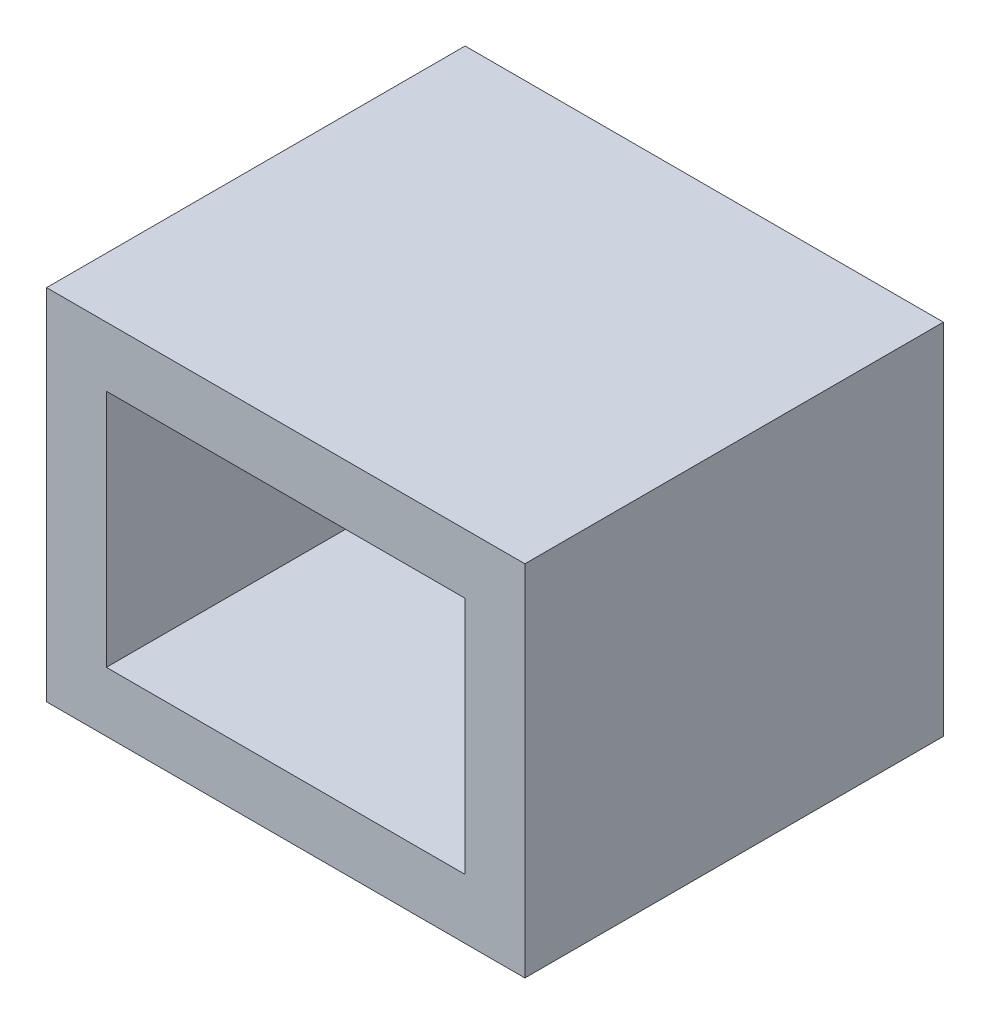
ISO-10303-21;
HEADER;
FILE_DESCRIPTION(('STEP AP214'),'2;1');
FILE_NAME('part.step','',(''),(''),'','','');
FILE_SCHEMA(('AUTOMOTIVE_DESIGN { 1 0 10303 214 1 1 1 1 }'));
ENDSEC;
DATA;
#1=APPLICATION_CONTEXT('core data for automotive mechanical design processes');
#2=APPLICATION_PROTOCOL_DEFINITION('international standard','automotive_design',2000,#1);
#3=PRODUCT_CONTEXT('',#1,'mechanical');
#4=PRODUCT('Part','Part','',(#3));
#5=PRODUCT_RELATED_PRODUCT_CATEGORY('part','',(#4));
#6=PRODUCT_DEFINITION_FORMATION('','',#4);
#7=PRODUCT_DEFINITION_CONTEXT('part definition',#1,'design');
#8=PRODUCT_DEFINITION('design','',#6,#7);
#9=PRODUCT_DEFINITION_SHAPE('','',#8);
#10=(LENGTH_UNIT() NAMED_UNIT(*) SI_UNIT(.MILLI.,.METRE.));
#11=(NAMED_UNIT(*) PLANE_ANGLE_UNIT() SI_UNIT($,.RADIAN.));
#12=(NAMED_UNIT(*) SI_UNIT($,.STERADIAN.) SOLID_ANGLE_UNIT());
#13=UNCERTAINTY_MEASURE_WITH_UNIT(LENGTH_MEASURE(1.E-05),#10,'distance_accuracy_value','');
#14=(GEOMETRIC_REPRESENTATION_CONTEXT(3) GLOBAL_UNCERTAINTY_ASSIGNED_CONTEXT((#13)) GLOBAL_UNIT_ASSIGNED_CONTEXT((#10,
#11,#12)) REPRESENTATION_CONTEXT('',''));
#15=CARTESIAN_POINT('',(0.,0.,0.));
#16=DIRECTION('',(0.,0.,1.));
#17=DIRECTION('',(1.,0.,0.));
#18=AXIS2_PLACEMENT_3D('',#15,#16,#17);
#19=CARTESIAN_POINT('',(0.,0.,6.));
#20=DIRECTION('',(0.,0.,1.));
#21=DIRECTION('',(1.,0.,0.));
#22=AXIS2_PLACEMENT_3D('',#19,#20,#21);
#23=PLANE('',#22);
#24=DIRECTION('',(0.,-1.,0.));
#25=VECTOR('',#24,1.);
#26=CARTESIAN_POINT('',(-28.4352755283429,7.88828415671745,6.));
#27=LINE('',#26,#25);
#28=CARTESIAN_POINT('',(-28.4352755283429,7.88828415671745,6.));
#29=VERTEX_POINT('',#28);
#30=CARTESIAN_POINT('',(-28.4352755283429,1.88828415671745,6.));
#31=VERTEX_POINT('',#30);
#32=EDGE_CURVE('E152',#29,#31,#27,.T.);
#33=ORIENTED_EDGE('',*,*,#32,.T.);
#34=DIRECTION('',(1.,0.,0.));
#35=VECTOR('',#34,1.);
#36=CARTESIAN_POINT('',(-28.4352755283429,1.88828415671745,6.));
#37=LINE('',#36,#35);
#38=CARTESIAN_POINT('',(-20.4352755283429,1.88828415671745,6.));
#39=VERTEX_POINT('',#38);
#40=EDGE_CURVE('E154',#31,#39,#37,.T.);
#41=ORIENTED_EDGE('',*,*,#40,.T.);
#42=DIRECTION('',(0.,1.,0.));
#43=VECTOR('',#42,1.);
#44=CARTESIAN_POINT('',(-20.4352755283429,7.88828415671745,6.));
#45=LINE('',#44,#43);
#46=CARTESIAN_POINT('',(-20.4352755283429,7.88828415671745,6.));
#47=VERTEX_POINT('',#46);
#48=EDGE_CURVE('E104',#39,#47,#45,.T.);
#49=ORIENTED_EDGE('',*,*,#48,.T.);
#50=DIRECTION('',(-1.,0.,0.));
#51=VECTOR('',#50,1.);
#52=CARTESIAN_POINT('',(-28.4352755283429,7.88828415671745,6.));
#53=LINE('',#52,#51);
#54=EDGE_CURVE('E56',#47,#29,#53,.T.);
#55=ORIENTED_EDGE('',*,*,#54,.T.);
#56=EDGE_LOOP('',(#33,#41,#49,#55));
#57=FACE_BOUND('',#56,.T.);
#58=DIRECTION('',(1.,0.,0.));
#59=VECTOR('',#58,1.);
#60=CARTESIAN_POINT('',(-27.4352755283429,2.88828415671745,6.));
#61=LINE('',#60,#59);
#62=CARTESIAN_POINT('',(-27.4352755283429,2.88828415671745,6.));
#63=VERTEX_POINT('',#62);
#64=CARTESIAN_POINT('',(-21.4352755283429,2.88828415671745,6.));
#65=VERTEX_POINT('',#64);
#66=EDGE_CURVE('E127',#63,#65,#61,.T.);
#67=ORIENTED_EDGE('',*,*,#66,.F.);
#68=DIRECTION('',(0.,-1.,0.));
#69=VECTOR('',#68,1.);
#70=CARTESIAN_POINT('',(-27.4352755283429,6.88828415671745,6.));
#71=LINE('',#70,#69);
#72=CARTESIAN_POINT('',(-27.4352755283429,6.88828415671745,6.));
#73=VERTEX_POINT('',#72);
#74=EDGE_CURVE('E125',#73,#63,#71,.T.);
#75=ORIENTED_EDGE('',*,*,#74,.F.);
#76=DIRECTION('',(-1.,0.,0.));
#77=VECTOR('',#76,1.);
#78=CARTESIAN_POINT('',(-27.4352755283429,6.88828415671745,6.));
#79=LINE('',#78,#77);
#80=CARTESIAN_POINT('',(-21.4352755283429,6.88828415671745,6.));
#81=VERTEX_POINT('',#80);
#82=EDGE_CURVE('E132',#81,#73,#79,.T.);
#83=ORIENTED_EDGE('',*,*,#82,.F.);
#84=DIRECTION('',(0.,1.,0.));
#85=VECTOR('',#84,1.);
#86=CARTESIAN_POINT('',(-21.4352755283429,6.88828415671745,6.));
#87=LINE('',#86,#85);
#88=EDGE_CURVE('E130',#65,#81,#87,.T.);
#89=ORIENTED_EDGE('',*,*,#88,.F.);
#90=EDGE_LOOP('',(#67,#75,#83,#89));
#91=FACE_BOUND('',#90,.T.);
#92=ADVANCED_FACE('F33',(#57,#91),#23,.T.);
#93=CARTESIAN_POINT('',(-28.4352755283429,7.88828415671745,6.));
#94=DIRECTION('',(1.,0.,0.));
#95=DIRECTION('',(0.,0.,-1.));
#96=AXIS2_PLACEMENT_3D('',#93,#94,#95);
#97=PLANE('',#96);
#98=DIRECTION('',(0.,0.,-1.));
#99=VECTOR('',#98,1.);
#100=CARTESIAN_POINT('',(-28.4352755283429,7.88828415671745,6.));
#101=LINE('',#100,#99);
#102=CARTESIAN_POINT('',(-28.4352755283429,7.88828415671745,-1.));
#103=VERTEX_POINT('',#102);
#104=EDGE_CURVE('E158',#29,#103,#101,.T.);
#105=ORIENTED_EDGE('',*,*,#104,.T.);
#106=DIRECTION('',(0.,1.,0.));
#107=VECTOR('',#106,1.);
#108=CARTESIAN_POINT('',(-28.4352755283429,7.88828415671745,-1.));
#109=LINE('',#108,#107);
#110=CARTESIAN_POINT('',(-28.4352755283429,1.88828415671745,-1.));
#111=VERTEX_POINT('',#110);
#112=EDGE_CURVE('E114',#111,#103,#109,.T.);
#113=ORIENTED_EDGE('',*,*,#112,.F.);
#114=DIRECTION('',(0.,0.,-1.));
#115=VECTOR('',#114,1.);
#116=CARTESIAN_POINT('',(-28.4352755283429,1.88828415671745,6.));
#117=LINE('',#116,#115);
#118=EDGE_CURVE('E11',#31,#111,#117,.T.);
#119=ORIENTED_EDGE('',*,*,#118,.F.);
#120=ORIENTED_EDGE('',*,*,#32,.F.);
#121=EDGE_LOOP('',(#105,#113,#119,#120));
#122=FACE_BOUND('',#121,.T.);
#123=ADVANCED_FACE('F35',(#122),#97,.F.);
#124=CARTESIAN_POINT('',(-28.4352755283429,1.88828415671745,6.));
#125=DIRECTION('',(0.,1.,0.));
#126=DIRECTION('',(0.,0.,1.));
#127=AXIS2_PLACEMENT_3D('',#124,#125,#126);
#128=PLANE('',#127);
#129=ORIENTED_EDGE('',*,*,#118,.T.);
#130=DIRECTION('',(-1.,0.,0.));
#131=VECTOR('',#130,1.);
#132=CARTESIAN_POINT('',(-20.4352755283429,1.88828415671745,-1.));
#133=LINE('',#132,#131);
#134=CARTESIAN_POINT('',(-20.4352755283429,1.88828415671745,-1.));
#135=VERTEX_POINT('',#134);
#136=EDGE_CURVE('E108',#135,#111,#133,.T.);
#137=ORIENTED_EDGE('',*,*,#136,.F.);
#138=DIRECTION('',(0.,0.,-1.));
#139=VECTOR('',#138,1.);
#140=CARTESIAN_POINT('',(-20.4352755283429,1.88828415671745,6.));
#141=LINE('',#140,#139);
#142=EDGE_CURVE('E41',#39,#135,#141,.T.);
#143=ORIENTED_EDGE('',*,*,#142,.F.);
#144=ORIENTED_EDGE('',*,*,#40,.F.);
#145=EDGE_LOOP('',(#129,#137,#143,#144));
#146=FACE_BOUND('',#145,.T.);
#147=ADVANCED_FACE('F109',(#146),#128,.F.);
#148=CARTESIAN_POINT('',(-20.4352755283429,7.88828415671745,6.));
#149=DIRECTION('',(-1.,0.,0.));
#150=DIRECTION('',(0.,-1.,0.));
#151=AXIS2_PLACEMENT_3D('',#148,#149,#150);
#152=PLANE('',#151);
#153=ORIENTED_EDGE('',*,*,#142,.T.);
#154=DIRECTION('',(0.,-1.,0.));
#155=VECTOR('',#154,1.);
#156=CARTESIAN_POINT('',(-20.4352755283429,7.88828415671745,-1.));
#157=LINE('',#156,#155);
#158=CARTESIAN_POINT('',(-20.4352755283429,7.88828415671745,-1.));
#159=VERTEX_POINT('',#158);
#160=EDGE_CURVE('E103',#159,#135,#157,.T.);
#161=ORIENTED_EDGE('',*,*,#160,.F.);
#162=DIRECTION('',(0.,0.,-1.));
#163=VECTOR('',#162,1.);
#164=CARTESIAN_POINT('',(-20.4352755283429,7.88828415671745,6.));
#165=LINE('',#164,#163);
#166=EDGE_CURVE('E106',#47,#159,#165,.T.);
#167=ORIENTED_EDGE('',*,*,#166,.F.);
#168=ORIENTED_EDGE('',*,*,#48,.F.);
#169=EDGE_LOOP('',(#153,#161,#167,#168));
#170=FACE_BOUND('',#169,.T.);
#171=ADVANCED_FACE('F100',(#170),#152,.F.);
#172=CARTESIAN_POINT('',(-28.4352755283429,7.88828415671745,6.));
#173=DIRECTION('',(0.,-1.,0.));
#174=DIRECTION('',(0.,0.,-1.));
#175=AXIS2_PLACEMENT_3D('',#172,#173,#174);
#176=PLANE('',#175);
#177=ORIENTED_EDGE('',*,*,#166,.T.);
#178=DIRECTION('',(1.,0.,0.));
#179=VECTOR('',#178,1.);
#180=CARTESIAN_POINT('',(-20.4352755283429,7.88828415671745,-1.));
#181=LINE('',#180,#179);
#182=EDGE_CURVE('E119',#103,#159,#181,.T.);
#183=ORIENTED_EDGE('',*,*,#182,.F.);
#184=ORIENTED_EDGE('',*,*,#104,.F.);
#185=ORIENTED_EDGE('',*,*,#54,.F.);
#186=EDGE_LOOP('',(#177,#183,#184,#185));
#187=FACE_BOUND('',#186,.T.);
#188=ADVANCED_FACE('F161',(#187),#176,.F.);
#189=CARTESIAN_POINT('',(-27.4352755283429,6.88828415671745,6.));
#190=DIRECTION('',(1.,0.,0.));
#191=DIRECTION('',(0.,1.,0.));
#192=AXIS2_PLACEMENT_3D('',#189,#190,#191);
#193=PLANE('',#192);
#194=DIRECTION('',(0.,-1.,0.));
#195=VECTOR('',#194,1.);
#196=CARTESIAN_POINT('',(-27.4352755283429,6.88828415671745,0.));
#197=LINE('',#196,#195);
#198=CARTESIAN_POINT('',(-27.4352755283429,6.88828415671745,0.));
#199=VERTEX_POINT('',#198);
#200=CARTESIAN_POINT('',(-27.4352755283429,2.88828415671745,0.));
#201=VERTEX_POINT('',#200);
#202=EDGE_CURVE('E124',#199,#201,#197,.T.);
#203=ORIENTED_EDGE('',*,*,#202,.F.);
#204=DIRECTION('',(0.,0.,-1.));
#205=VECTOR('',#204,1.);
#206=CARTESIAN_POINT('',(-27.4352755283429,6.88828415671745,6.));
#207=LINE('',#206,#205);
#208=EDGE_CURVE('E134',#73,#199,#207,.T.);
#209=ORIENTED_EDGE('',*,*,#208,.F.);
#210=ORIENTED_EDGE('',*,*,#74,.T.);
#211=DIRECTION('',(0.,0.,-1.));
#212=VECTOR('',#211,1.);
#213=CARTESIAN_POINT('',(-27.4352755283429,2.88828415671745,6.));
#214=LINE('',#213,#212);
#215=EDGE_CURVE('E149',#63,#201,#214,.T.);
#216=ORIENTED_EDGE('',*,*,#215,.T.);
#217=EDGE_LOOP('',(#203,#209,#210,#216));
#218=FACE_BOUND('',#217,.T.);
#219=ADVANCED_FACE('F182',(#218),#193,.T.);
#220=CARTESIAN_POINT('',(-27.4352755283429,2.88828415671745,6.));
#221=DIRECTION('',(0.,1.,0.));
#222=DIRECTION('',(0.,0.,1.));
#223=AXIS2_PLACEMENT_3D('',#220,#221,#222);
#224=PLANE('',#223);
#225=DIRECTION('',(1.,0.,0.));
#226=VECTOR('',#225,1.);
#227=CARTESIAN_POINT('',(-27.4352755283429,2.88828415671745,0.));
#228=LINE('',#227,#226);
#229=CARTESIAN_POINT('',(-21.4352755283429,2.88828415671745,0.));
#230=VERTEX_POINT('',#229);
#231=EDGE_CURVE('E137',#201,#230,#228,.T.);
#232=ORIENTED_EDGE('',*,*,#231,.F.);
#233=ORIENTED_EDGE('',*,*,#215,.F.);
#234=ORIENTED_EDGE('',*,*,#66,.T.);
#235=DIRECTION('',(0.,0.,-1.));
#236=VECTOR('',#235,1.);
#237=CARTESIAN_POINT('',(-21.4352755283429,2.88828415671745,6.));
#238=LINE('',#237,#236);
#239=EDGE_CURVE('E147',#65,#230,#238,.T.);
#240=ORIENTED_EDGE('',*,*,#239,.T.);
#241=EDGE_LOOP('',(#232,#233,#234,#240));
#242=FACE_BOUND('',#241,.T.);
#243=ADVANCED_FACE('F174',(#242),#224,.T.);
#244=CARTESIAN_POINT('',(-21.4352755283429,6.88828415671745,6.));
#245=DIRECTION('',(-1.,0.,0.));
#246=DIRECTION('',(0.,0.,1.));
#247=AXIS2_PLACEMENT_3D('',#244,#245,#246);
#248=PLANE('',#247);
#249=DIRECTION('',(0.,1.,0.));
#250=VECTOR('',#249,1.);
#251=CARTESIAN_POINT('',(-21.4352755283429,6.88828415671745,0.));
#252=LINE('',#251,#250);
#253=CARTESIAN_POINT('',(-21.4352755283429,6.88828415671745,0.));
#254=VERTEX_POINT('',#253);
#255=EDGE_CURVE('E140',#230,#254,#252,.T.);
#256=ORIENTED_EDGE('',*,*,#255,.F.);
#257=ORIENTED_EDGE('',*,*,#239,.F.);
#258=ORIENTED_EDGE('',*,*,#88,.T.);
#259=DIRECTION('',(0.,0.,-1.));
#260=VECTOR('',#259,1.);
#261=CARTESIAN_POINT('',(-21.4352755283429,6.88828415671745,6.));
#262=LINE('',#261,#260);
#263=EDGE_CURVE('E48',#81,#254,#262,.T.);
#264=ORIENTED_EDGE('',*,*,#263,.T.);
#265=EDGE_LOOP('',(#256,#257,#258,#264));
#266=FACE_BOUND('',#265,.T.);
#267=ADVANCED_FACE('F177',(#266),#248,.T.);
#268=CARTESIAN_POINT('',(-27.4352755283429,6.88828415671745,6.));
#269=DIRECTION('',(0.,-1.,0.));
#270=DIRECTION('',(0.,0.,-1.));
#271=AXIS2_PLACEMENT_3D('',#268,#269,#270);
#272=PLANE('',#271);
#273=DIRECTION('',(-1.,0.,0.));
#274=VECTOR('',#273,1.);
#275=CARTESIAN_POINT('',(-27.4352755283429,6.88828415671745,0.));
#276=LINE('',#275,#274);
#277=EDGE_CURVE('E128',#254,#199,#276,.T.);
#278=ORIENTED_EDGE('',*,*,#277,.F.);
#279=ORIENTED_EDGE('',*,*,#263,.F.);
#280=ORIENTED_EDGE('',*,*,#82,.T.);
#281=ORIENTED_EDGE('',*,*,#208,.T.);
#282=EDGE_LOOP('',(#278,#279,#280,#281));
#283=FACE_BOUND('',#282,.T.);
#284=ADVANCED_FACE('F184',(#283),#272,.T.);
#285=CARTESIAN_POINT('',(0.,0.,0.));
#286=DIRECTION('',(0.,0.,-1.));
#287=DIRECTION('',(-1.,0.,0.));
#288=AXIS2_PLACEMENT_3D('',#285,#286,#287);
#289=PLANE('',#288);
#290=ORIENTED_EDGE('',*,*,#202,.T.);
#291=ORIENTED_EDGE('',*,*,#231,.T.);
#292=ORIENTED_EDGE('',*,*,#255,.T.);
#293=ORIENTED_EDGE('',*,*,#277,.T.);
#294=EDGE_LOOP('',(#290,#291,#292,#293));
#295=FACE_BOUND('',#294,.T.);
#296=ADVANCED_FACE('F179',(#295),#289,.F.);
#297=CARTESIAN_POINT('',(0.,0.,-1.));
#298=DIRECTION('',(0.,0.,-1.));
#299=DIRECTION('',(-1.,0.,0.));
#300=AXIS2_PLACEMENT_3D('',#297,#298,#299);
#301=PLANE('',#300);
#302=ORIENTED_EDGE('',*,*,#160,.T.);
#303=ORIENTED_EDGE('',*,*,#136,.T.);
#304=ORIENTED_EDGE('',*,*,#112,.T.);
#305=ORIENTED_EDGE('',*,*,#182,.T.);
#306=EDGE_LOOP('',(#302,#303,#304,#305));
#307=FACE_BOUND('',#306,.T.);
#308=ADVANCED_FACE('F117',(#307),#301,.T.);
#309=CLOSED_SHELL('',(#92,#123,#147,#171,#188,#219,#243,#267,#284,#296,#308));
#310=MANIFOLD_SOLID_BREP('B2',#309);
#311=ADVANCED_BREP_SHAPE_REPRESENTATION('',(#18,#310),#14);
#312=SHAPE_DEFINITION_REPRESENTATION(#9,#311);
ENDSEC;
END-ISO-10303-21;
